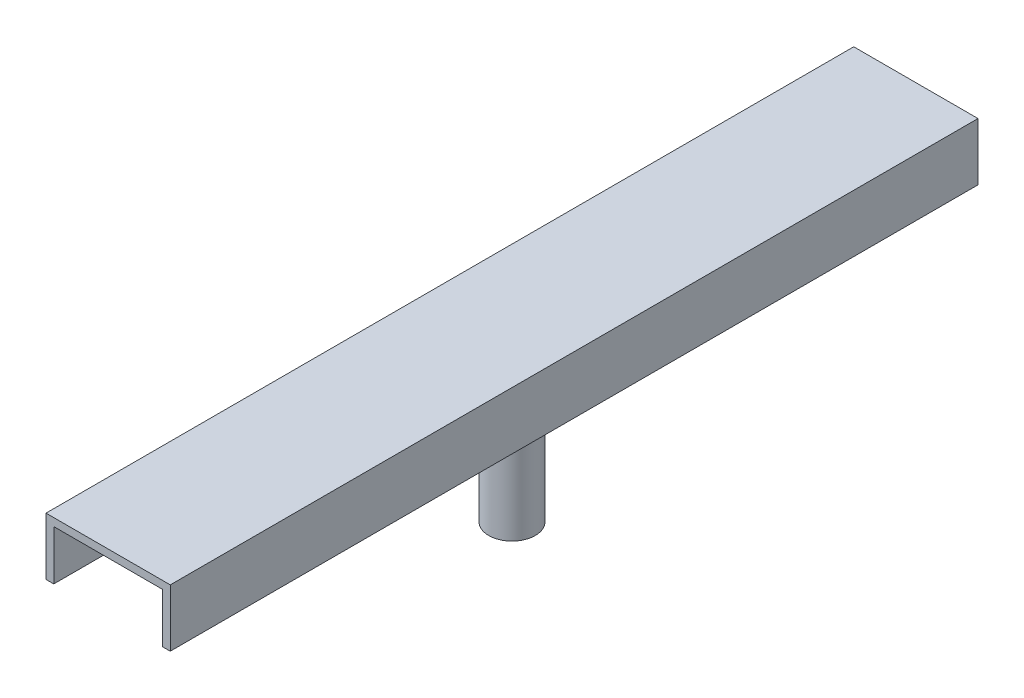
ISO-10303-21;
HEADER;
FILE_DESCRIPTION(('STEP AP214'),'2;1');
FILE_NAME('part.step','',(''),(''),'','','');
FILE_SCHEMA(('AUTOMOTIVE_DESIGN { 1 0 10303 214 1 1 1 1 }'));
ENDSEC;
DATA;
#1=APPLICATION_CONTEXT('core data for automotive mechanical design processes');
#2=APPLICATION_PROTOCOL_DEFINITION('international standard','automotive_design',2000,#1);
#3=PRODUCT_CONTEXT('',#1,'mechanical');
#4=PRODUCT('Part','Part','',(#3));
#5=PRODUCT_RELATED_PRODUCT_CATEGORY('part','',(#4));
#6=PRODUCT_DEFINITION_FORMATION('','',#4);
#7=PRODUCT_DEFINITION_CONTEXT('part definition',#1,'design');
#8=PRODUCT_DEFINITION('design','',#6,#7);
#9=PRODUCT_DEFINITION_SHAPE('','',#8);
#10=(LENGTH_UNIT() NAMED_UNIT(*) SI_UNIT(.MILLI.,.METRE.));
#11=(NAMED_UNIT(*) PLANE_ANGLE_UNIT() SI_UNIT($,.RADIAN.));
#12=(NAMED_UNIT(*) SI_UNIT($,.STERADIAN.) SOLID_ANGLE_UNIT());
#13=UNCERTAINTY_MEASURE_WITH_UNIT(LENGTH_MEASURE(1.E-05),#10,'distance_accuracy_value','');
#14=(GEOMETRIC_REPRESENTATION_CONTEXT(3) GLOBAL_UNCERTAINTY_ASSIGNED_CONTEXT((#13)) GLOBAL_UNIT_ASSIGNED_CONTEXT((#10,
#11,#12)) REPRESENTATION_CONTEXT('',''));
#15=CARTESIAN_POINT('',(0.,0.,0.));
#16=DIRECTION('',(0.,0.,1.));
#17=DIRECTION('',(1.,0.,0.));
#18=AXIS2_PLACEMENT_3D('',#15,#16,#17);
#19=CARTESIAN_POINT('',(-44.45,17.145,330.2));
#20=DIRECTION('',(0.,1.,0.));
#21=DIRECTION('',(-1.,0.,0.));
#22=AXIS2_PLACEMENT_3D('',#19,#20,#21);
#23=PLANE('',#22);
#24=DIRECTION('',(1.,0.,0.));
#25=VECTOR('',#24,1.);
#26=CARTESIAN_POINT('',(-44.45,17.145,-330.2));
#27=LINE('',#26,#25);
#28=CARTESIAN_POINT('',(-44.45,17.145,-330.2));
#29=VERTEX_POINT('',#28);
#30=CARTESIAN_POINT('',(44.45,17.145,-330.2));
#31=VERTEX_POINT('',#30);
#32=EDGE_CURVE('E121',#29,#31,#27,.T.);
#33=ORIENTED_EDGE('',*,*,#32,.T.);
#34=DIRECTION('',(0.,0.,-1.));
#35=VECTOR('',#34,1.);
#36=CARTESIAN_POINT('',(44.45,17.145,330.2));
#37=LINE('',#36,#35);
#38=CARTESIAN_POINT('',(44.45,17.145,330.2));
#39=VERTEX_POINT('',#38);
#40=EDGE_CURVE('E118',#39,#31,#37,.T.);
#41=ORIENTED_EDGE('',*,*,#40,.F.);
#42=DIRECTION('',(1.,0.,0.));
#43=VECTOR('',#42,1.);
#44=CARTESIAN_POINT('',(-44.45,17.145,330.2));
#45=LINE('',#44,#43);
#46=CARTESIAN_POINT('',(-44.45,17.145,330.2));
#47=VERTEX_POINT('',#46);
#48=EDGE_CURVE('E107',#47,#39,#45,.T.);
#49=ORIENTED_EDGE('',*,*,#48,.F.);
#50=DIRECTION('',(0.,0.,-1.));
#51=VECTOR('',#50,1.);
#52=CARTESIAN_POINT('',(-44.45,17.145,330.2));
#53=LINE('',#52,#51);
#54=EDGE_CURVE('E122',#47,#29,#53,.T.);
#55=ORIENTED_EDGE('',*,*,#54,.T.);
#56=EDGE_LOOP('',(#33,#41,#49,#55));
#57=FACE_BOUND('',#56,.T.);
#58=CARTESIAN_POINT('',(0.,17.145,0.));
#59=DIRECTION('',(0.,1.,0.));
#60=DIRECTION('',(-1.,0.,0.));
#61=AXIS2_PLACEMENT_3D('',#58,#59,#60);
#62=CIRCLE('',#61,19.05);
#63=CARTESIAN_POINT('',(-19.05,17.145,0.));
#64=VERTEX_POINT('',#63);
#65=EDGE_CURVE('E11',#64,#64,#62,.F.);
#66=ORIENTED_EDGE('',*,*,#65,.F.);
#67=EDGE_LOOP('',(#66));
#68=FACE_BOUND('',#67,.T.);
#69=ADVANCED_FACE('F33',(#57,#68),#23,.F.);
#70=CARTESIAN_POINT('',(50.8,-23.495,330.2));
#71=DIRECTION('',(-1.,0.,0.));
#72=DIRECTION('',(0.,0.,1.));
#73=AXIS2_PLACEMENT_3D('',#70,#71,#72);
#74=PLANE('',#73);
#75=DIRECTION('',(0.,1.,0.));
#76=VECTOR('',#75,1.);
#77=CARTESIAN_POINT('',(50.8,-23.495,-330.2));
#78=LINE('',#77,#76);
#79=CARTESIAN_POINT('',(50.8,-23.495,-330.2));
#80=VERTEX_POINT('',#79);
#81=CARTESIAN_POINT('',(50.8,23.495,-330.2));
#82=VERTEX_POINT('',#81);
#83=EDGE_CURVE('E131',#80,#82,#78,.T.);
#84=ORIENTED_EDGE('',*,*,#83,.T.);
#85=DIRECTION('',(0.,0.,-1.));
#86=VECTOR('',#85,1.);
#87=CARTESIAN_POINT('',(50.8,23.495,330.2));
#88=LINE('',#87,#86);
#89=CARTESIAN_POINT('',(50.8,23.495,330.2));
#90=VERTEX_POINT('',#89);
#91=EDGE_CURVE('E42',#90,#82,#88,.T.);
#92=ORIENTED_EDGE('',*,*,#91,.F.);
#93=DIRECTION('',(0.,1.,0.));
#94=VECTOR('',#93,1.);
#95=CARTESIAN_POINT('',(50.8,-23.495,330.2));
#96=LINE('',#95,#94);
#97=CARTESIAN_POINT('',(50.8,-23.495,330.2));
#98=VERTEX_POINT('',#97);
#99=EDGE_CURVE('E146',#98,#90,#96,.T.);
#100=ORIENTED_EDGE('',*,*,#99,.F.);
#101=DIRECTION('',(0.,0.,-1.));
#102=VECTOR('',#101,1.);
#103=CARTESIAN_POINT('',(50.8,-23.495,330.2));
#104=LINE('',#103,#102);
#105=EDGE_CURVE('E127',#98,#80,#104,.T.);
#106=ORIENTED_EDGE('',*,*,#105,.T.);
#107=EDGE_LOOP('',(#84,#92,#100,#106));
#108=FACE_BOUND('',#107,.T.);
#109=ADVANCED_FACE('F35',(#108),#74,.F.);
#110=CARTESIAN_POINT('',(-50.8,23.495,330.2));
#111=DIRECTION('',(0.,-1.,0.));
#112=DIRECTION('',(1.,0.,0.));
#113=AXIS2_PLACEMENT_3D('',#110,#111,#112);
#114=PLANE('',#113);
#115=DIRECTION('',(-1.,0.,0.));
#116=VECTOR('',#115,1.);
#117=CARTESIAN_POINT('',(-50.8,23.495,-330.2));
#118=LINE('',#117,#116);
#119=CARTESIAN_POINT('',(-50.8,23.495,-330.2));
#120=VERTEX_POINT('',#119);
#121=EDGE_CURVE('E134',#82,#120,#118,.T.);
#122=ORIENTED_EDGE('',*,*,#121,.T.);
#123=DIRECTION('',(0.,0.,-1.));
#124=VECTOR('',#123,1.);
#125=CARTESIAN_POINT('',(-50.8,23.495,330.2));
#126=LINE('',#125,#124);
#127=CARTESIAN_POINT('',(-50.8,23.495,330.2));
#128=VERTEX_POINT('',#127);
#129=EDGE_CURVE('E156',#128,#120,#126,.T.);
#130=ORIENTED_EDGE('',*,*,#129,.F.);
#131=DIRECTION('',(-1.,0.,0.));
#132=VECTOR('',#131,1.);
#133=CARTESIAN_POINT('',(-50.8,23.495,330.2));
#134=LINE('',#133,#132);
#135=EDGE_CURVE('E94',#90,#128,#134,.T.);
#136=ORIENTED_EDGE('',*,*,#135,.F.);
#137=ORIENTED_EDGE('',*,*,#91,.T.);
#138=EDGE_LOOP('',(#122,#130,#136,#137));
#139=FACE_BOUND('',#138,.T.);
#140=ADVANCED_FACE('F159',(#139),#114,.F.);
#141=CARTESIAN_POINT('',(-50.8,-23.495,330.2));
#142=DIRECTION('',(1.,0.,0.));
#143=DIRECTION('',(0.,0.,-1.));
#144=AXIS2_PLACEMENT_3D('',#141,#142,#143);
#145=PLANE('',#144);
#146=DIRECTION('',(0.,-1.,0.));
#147=VECTOR('',#146,1.);
#148=CARTESIAN_POINT('',(-50.8,-23.495,-330.2));
#149=LINE('',#148,#147);
#150=CARTESIAN_POINT('',(-50.8,-23.495,-330.2));
#151=VERTEX_POINT('',#150);
#152=EDGE_CURVE('E137',#120,#151,#149,.T.);
#153=ORIENTED_EDGE('',*,*,#152,.T.);
#154=DIRECTION('',(0.,0.,-1.));
#155=VECTOR('',#154,1.);
#156=CARTESIAN_POINT('',(-50.8,-23.495,330.2));
#157=LINE('',#156,#155);
#158=CARTESIAN_POINT('',(-50.8,-23.495,330.2));
#159=VERTEX_POINT('',#158);
#160=EDGE_CURVE('E153',#159,#151,#157,.T.);
#161=ORIENTED_EDGE('',*,*,#160,.F.);
#162=DIRECTION('',(0.,-1.,0.));
#163=VECTOR('',#162,1.);
#164=CARTESIAN_POINT('',(-50.8,-23.495,330.2));
#165=LINE('',#164,#163);
#166=EDGE_CURVE('E177',#128,#159,#165,.T.);
#167=ORIENTED_EDGE('',*,*,#166,.F.);
#168=ORIENTED_EDGE('',*,*,#129,.T.);
#169=EDGE_LOOP('',(#153,#161,#167,#168));
#170=FACE_BOUND('',#169,.T.);
#171=ADVANCED_FACE('F170',(#170),#145,.F.);
#172=CARTESIAN_POINT('',(-50.8,-23.495,330.2));
#173=DIRECTION('',(0.,1.,0.));
#174=DIRECTION('',(0.,0.,1.));
#175=AXIS2_PLACEMENT_3D('',#172,#173,#174);
#176=PLANE('',#175);
#177=DIRECTION('',(1.,0.,0.));
#178=VECTOR('',#177,1.);
#179=CARTESIAN_POINT('',(-50.8,-23.495,-330.2));
#180=LINE('',#179,#178);
#181=CARTESIAN_POINT('',(-44.45,-23.495,-330.2));
#182=VERTEX_POINT('',#181);
#183=EDGE_CURVE('E139',#151,#182,#180,.T.);
#184=ORIENTED_EDGE('',*,*,#183,.T.);
#185=DIRECTION('',(0.,0.,-1.));
#186=VECTOR('',#185,1.);
#187=CARTESIAN_POINT('',(-44.45,-23.495,330.2));
#188=LINE('',#187,#186);
#189=CARTESIAN_POINT('',(-44.45,-23.495,330.2));
#190=VERTEX_POINT('',#189);
#191=EDGE_CURVE('E150',#190,#182,#188,.T.);
#192=ORIENTED_EDGE('',*,*,#191,.F.);
#193=DIRECTION('',(1.,0.,0.));
#194=VECTOR('',#193,1.);
#195=CARTESIAN_POINT('',(-50.8,-23.495,330.2));
#196=LINE('',#195,#194);
#197=EDGE_CURVE('E176',#159,#190,#196,.T.);
#198=ORIENTED_EDGE('',*,*,#197,.F.);
#199=ORIENTED_EDGE('',*,*,#160,.T.);
#200=EDGE_LOOP('',(#184,#192,#198,#199));
#201=FACE_BOUND('',#200,.T.);
#202=ADVANCED_FACE('F174',(#201),#176,.F.);
#203=CARTESIAN_POINT('',(-44.45,-23.495,330.2));
#204=DIRECTION('',(-1.,0.,0.));
#205=DIRECTION('',(0.,0.,1.));
#206=AXIS2_PLACEMENT_3D('',#203,#204,#205);
#207=PLANE('',#206);
#208=DIRECTION('',(0.,1.,0.));
#209=VECTOR('',#208,1.);
#210=CARTESIAN_POINT('',(-44.45,-23.495,-330.2));
#211=LINE('',#210,#209);
#212=EDGE_CURVE('E141',#182,#29,#211,.T.);
#213=ORIENTED_EDGE('',*,*,#212,.T.);
#214=ORIENTED_EDGE('',*,*,#54,.F.);
#215=DIRECTION('',(0.,1.,0.));
#216=VECTOR('',#215,1.);
#217=CARTESIAN_POINT('',(-44.45,-23.495,330.2));
#218=LINE('',#217,#216);
#219=EDGE_CURVE('E113',#190,#47,#218,.T.);
#220=ORIENTED_EDGE('',*,*,#219,.F.);
#221=ORIENTED_EDGE('',*,*,#191,.T.);
#222=EDGE_LOOP('',(#213,#214,#220,#221));
#223=FACE_BOUND('',#222,.T.);
#224=ADVANCED_FACE('F201',(#223),#207,.F.);
#225=CARTESIAN_POINT('',(44.45,17.145,330.2));
#226=DIRECTION('',(1.,0.,0.));
#227=DIRECTION('',(0.,0.,-1.));
#228=AXIS2_PLACEMENT_3D('',#225,#226,#227);
#229=PLANE('',#228);
#230=DIRECTION('',(0.,-1.,0.));
#231=VECTOR('',#230,1.);
#232=CARTESIAN_POINT('',(44.45,17.145,-330.2));
#233=LINE('',#232,#231);
#234=CARTESIAN_POINT('',(44.45,-23.495,-330.2));
#235=VERTEX_POINT('',#234);
#236=EDGE_CURVE('E79',#31,#235,#233,.T.);
#237=ORIENTED_EDGE('',*,*,#236,.T.);
#238=DIRECTION('',(0.,0.,-1.));
#239=VECTOR('',#238,1.);
#240=CARTESIAN_POINT('',(44.45,-23.495,330.2));
#241=LINE('',#240,#239);
#242=CARTESIAN_POINT('',(44.45,-23.495,330.2));
#243=VERTEX_POINT('',#242);
#244=EDGE_CURVE('E123',#243,#235,#241,.T.);
#245=ORIENTED_EDGE('',*,*,#244,.F.);
#246=DIRECTION('',(0.,-1.,0.));
#247=VECTOR('',#246,1.);
#248=CARTESIAN_POINT('',(44.45,17.145,330.2));
#249=LINE('',#248,#247);
#250=EDGE_CURVE('E111',#39,#243,#249,.T.);
#251=ORIENTED_EDGE('',*,*,#250,.F.);
#252=ORIENTED_EDGE('',*,*,#40,.T.);
#253=EDGE_LOOP('',(#237,#245,#251,#252));
#254=FACE_BOUND('',#253,.T.);
#255=ADVANCED_FACE('F125',(#254),#229,.F.);
#256=CARTESIAN_POINT('',(44.45,-23.495,330.2));
#257=DIRECTION('',(0.,1.,0.));
#258=DIRECTION('',(0.,0.,1.));
#259=AXIS2_PLACEMENT_3D('',#256,#257,#258);
#260=PLANE('',#259);
#261=DIRECTION('',(1.,0.,0.));
#262=VECTOR('',#261,1.);
#263=CARTESIAN_POINT('',(44.45,-23.495,-330.2));
#264=LINE('',#263,#262);
#265=EDGE_CURVE('E85',#235,#80,#264,.T.);
#266=ORIENTED_EDGE('',*,*,#265,.T.);
#267=ORIENTED_EDGE('',*,*,#105,.F.);
#268=DIRECTION('',(1.,0.,0.));
#269=VECTOR('',#268,1.);
#270=CARTESIAN_POINT('',(44.45,-23.495,330.2));
#271=LINE('',#270,#269);
#272=EDGE_CURVE('E50',#243,#98,#271,.T.);
#273=ORIENTED_EDGE('',*,*,#272,.F.);
#274=ORIENTED_EDGE('',*,*,#244,.T.);
#275=EDGE_LOOP('',(#266,#267,#273,#274));
#276=FACE_BOUND('',#275,.T.);
#277=ADVANCED_FACE('F231',(#276),#260,.F.);
#278=CARTESIAN_POINT('',(50.8,23.495,330.2));
#279=DIRECTION('',(0.,0.,-1.));
#280=DIRECTION('',(-1.,0.,0.));
#281=AXIS2_PLACEMENT_3D('',#278,#279,#280);
#282=PLANE('',#281);
#283=ORIENTED_EDGE('',*,*,#99,.T.);
#284=ORIENTED_EDGE('',*,*,#135,.T.);
#285=ORIENTED_EDGE('',*,*,#166,.T.);
#286=ORIENTED_EDGE('',*,*,#197,.T.);
#287=ORIENTED_EDGE('',*,*,#219,.T.);
#288=ORIENTED_EDGE('',*,*,#48,.T.);
#289=ORIENTED_EDGE('',*,*,#250,.T.);
#290=ORIENTED_EDGE('',*,*,#272,.T.);
#291=EDGE_LOOP('',(#283,#284,#285,#286,#287,#288,#289,#290));
#292=FACE_BOUND('',#291,.T.);
#293=ADVANCED_FACE('F109',(#292),#282,.F.);
#294=CARTESIAN_POINT('',(50.8,23.495,-330.2));
#295=DIRECTION('',(0.,0.,-1.));
#296=DIRECTION('',(-1.,0.,0.));
#297=AXIS2_PLACEMENT_3D('',#294,#295,#296);
#298=PLANE('',#297);
#299=ORIENTED_EDGE('',*,*,#83,.F.);
#300=ORIENTED_EDGE('',*,*,#265,.F.);
#301=ORIENTED_EDGE('',*,*,#236,.F.);
#302=ORIENTED_EDGE('',*,*,#32,.F.);
#303=ORIENTED_EDGE('',*,*,#212,.F.);
#304=ORIENTED_EDGE('',*,*,#183,.F.);
#305=ORIENTED_EDGE('',*,*,#152,.F.);
#306=ORIENTED_EDGE('',*,*,#121,.F.);
#307=EDGE_LOOP('',(#299,#300,#301,#302,#303,#304,#305,#306));
#308=FACE_BOUND('',#307,.T.);
#309=ADVANCED_FACE('F164',(#308),#298,.T.);
#310=CARTESIAN_POINT('',(0.,-122.555,0.));
#311=DIRECTION('',(0.,1.,0.));
#312=DIRECTION('',(-1.,0.,0.));
#313=AXIS2_PLACEMENT_3D('',#310,#311,#312);
#314=CYLINDRICAL_SURFACE('',#313,19.05);
#315=CARTESIAN_POINT('',(0.,-122.555,0.));
#316=DIRECTION('',(0.,-1.,0.));
#317=DIRECTION('',(1.,0.,0.));
#318=AXIS2_PLACEMENT_3D('',#315,#316,#317);
#319=CIRCLE('',#318,19.05);
#320=CARTESIAN_POINT('',(19.05,-122.555,0.));
#321=VERTEX_POINT('',#320);
#322=EDGE_CURVE('E135',#321,#321,#319,.T.);
#323=ORIENTED_EDGE('',*,*,#322,.F.);
#324=EDGE_LOOP('',(#323));
#325=FACE_BOUND('',#324,.T.);
#326=ORIENTED_EDGE('',*,*,#65,.T.);
#327=EDGE_LOOP('',(#326));
#328=FACE_BOUND('',#327,.T.);
#329=ADVANCED_FACE('F188',(#325,#328),#314,.T.);
#330=CARTESIAN_POINT('',(0.,-122.555,0.));
#331=DIRECTION('',(0.,-1.,0.));
#332=DIRECTION('',(1.,0.,0.));
#333=AXIS2_PLACEMENT_3D('',#330,#331,#332);
#334=PLANE('',#333);
#335=ORIENTED_EDGE('',*,*,#322,.T.);
#336=EDGE_LOOP('',(#335));
#337=FACE_BOUND('',#336,.T.);
#338=ADVANCED_FACE('F186',(#337),#334,.T.);
#339=CLOSED_SHELL('',(#69,#109,#140,#171,#202,#224,#255,#277,#293,#309,#329,#338));
#340=MANIFOLD_SOLID_BREP('B2',#339);
#341=ADVANCED_BREP_SHAPE_REPRESENTATION('',(#18,#340),#14);
#342=SHAPE_DEFINITION_REPRESENTATION(#9,#341);
ENDSEC;
END-ISO-10303-21;
